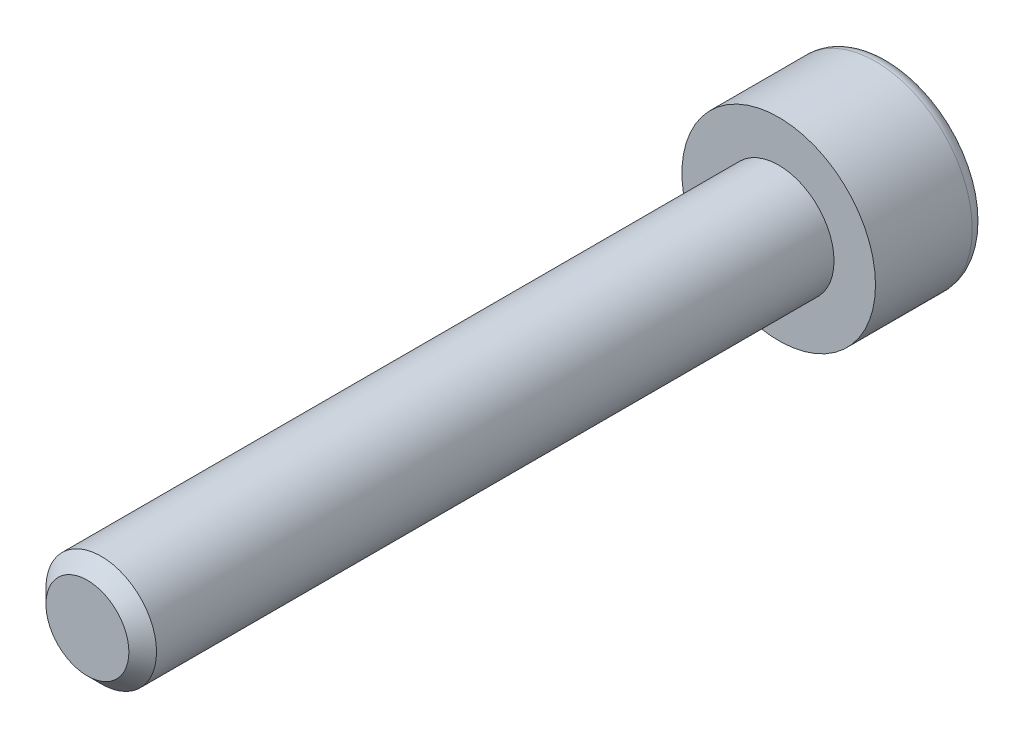
ISO-10303-21;
HEADER;
FILE_DESCRIPTION(('STEP AP214'),'2;1');
FILE_NAME('part.step','',(''),(''),'','','');
FILE_SCHEMA(('AUTOMOTIVE_DESIGN { 1 0 10303 214 1 1 1 1 }'));
ENDSEC;
DATA;
#1=APPLICATION_CONTEXT('core data for automotive mechanical design processes');
#2=APPLICATION_PROTOCOL_DEFINITION('international standard','automotive_design',2000,#1);
#3=PRODUCT_CONTEXT('',#1,'mechanical');
#4=PRODUCT('Part','Part','',(#3));
#5=PRODUCT_RELATED_PRODUCT_CATEGORY('part','',(#4));
#6=PRODUCT_DEFINITION_FORMATION('','',#4);
#7=PRODUCT_DEFINITION_CONTEXT('part definition',#1,'design');
#8=PRODUCT_DEFINITION('design','',#6,#7);
#9=PRODUCT_DEFINITION_SHAPE('','',#8);
#10=(LENGTH_UNIT() NAMED_UNIT(*) SI_UNIT(.MILLI.,.METRE.));
#11=(NAMED_UNIT(*) PLANE_ANGLE_UNIT() SI_UNIT($,.RADIAN.));
#12=(NAMED_UNIT(*) SI_UNIT($,.STERADIAN.) SOLID_ANGLE_UNIT());
#13=UNCERTAINTY_MEASURE_WITH_UNIT(LENGTH_MEASURE(1.E-05),#10,'distance_accuracy_value','');
#14=(GEOMETRIC_REPRESENTATION_CONTEXT(3) GLOBAL_UNCERTAINTY_ASSIGNED_CONTEXT((#13)) GLOBAL_UNIT_ASSIGNED_CONTEXT((#10,
#11,#12)) REPRESENTATION_CONTEXT('',''));
#15=CARTESIAN_POINT('',(0.,0.,0.));
#16=DIRECTION('',(0.,0.,1.));
#17=DIRECTION('',(1.,0.,0.));
#18=AXIS2_PLACEMENT_3D('',#15,#16,#17);
#19=CARTESIAN_POINT('',(0.,0.,4.));
#20=DIRECTION('',(0.,0.,1.));
#21=DIRECTION('',(1.,0.,0.));
#22=AXIS2_PLACEMENT_3D('',#19,#20,#21);
#23=PLANE('',#22);
#24=CARTESIAN_POINT('',(0.,0.,4.));
#25=DIRECTION('',(0.,0.,1.));
#26=DIRECTION('',(1.,0.,0.));
#27=AXIS2_PLACEMENT_3D('',#24,#25,#26);
#28=CIRCLE('',#27,3.5);
#29=CARTESIAN_POINT('',(3.5,0.,4.));
#30=VERTEX_POINT('',#29);
#31=EDGE_CURVE('E143',#30,#30,#28,.T.);
#32=ORIENTED_EDGE('',*,*,#31,.T.);
#33=EDGE_LOOP('',(#32));
#34=FACE_BOUND('',#33,.T.);
#35=CARTESIAN_POINT('',(0.,0.,4.));
#36=DIRECTION('',(0.,0.,1.));
#37=DIRECTION('',(1.,0.,0.));
#38=AXIS2_PLACEMENT_3D('',#35,#36,#37);
#39=CIRCLE('',#38,2.);
#40=CARTESIAN_POINT('',(2.,0.,4.));
#41=VERTEX_POINT('',#40);
#42=EDGE_CURVE('E135',#41,#41,#39,.T.);
#43=ORIENTED_EDGE('',*,*,#42,.F.);
#44=EDGE_LOOP('',(#43));
#45=FACE_BOUND('',#44,.T.);
#46=ADVANCED_FACE('F33',(#34,#45),#23,.T.);
#47=CARTESIAN_POINT('',(0.,0.,4.));
#48=DIRECTION('',(0.,0.,-1.));
#49=DIRECTION('',(-1.,0.,0.));
#50=AXIS2_PLACEMENT_3D('',#47,#48,#49);
#51=CYLINDRICAL_SURFACE('',#50,3.5);
#52=CARTESIAN_POINT('',(0.,0.,0.5));
#53=DIRECTION('',(0.,0.,1.));
#54=DIRECTION('',(1.,0.,0.));
#55=AXIS2_PLACEMENT_3D('',#52,#53,#54);
#56=CIRCLE('',#55,3.5);
#57=CARTESIAN_POINT('',(3.5,0.,0.5));
#58=VERTEX_POINT('',#57);
#59=EDGE_CURVE('E41',#58,#58,#56,.T.);
#60=ORIENTED_EDGE('',*,*,#59,.T.);
#61=EDGE_LOOP('',(#60));
#62=FACE_BOUND('',#61,.T.);
#63=ORIENTED_EDGE('',*,*,#31,.F.);
#64=EDGE_LOOP('',(#63));
#65=FACE_BOUND('',#64,.T.);
#66=ADVANCED_FACE('F154',(#62,#65),#51,.T.);
#67=CARTESIAN_POINT('',(0.,0.,0.));
#68=DIRECTION('',(0.,0.,1.));
#69=DIRECTION('',(1.,0.,0.));
#70=AXIS2_PLACEMENT_3D('',#67,#68,#69);
#71=PLANE('',#70);
#72=CARTESIAN_POINT('',(0.,0.,0.));
#73=DIRECTION('',(0.,0.,1.));
#74=DIRECTION('',(1.,0.,0.));
#75=AXIS2_PLACEMENT_3D('',#72,#73,#74);
#76=CIRCLE('',#75,3.);
#77=CARTESIAN_POINT('',(3.,0.,0.));
#78=VERTEX_POINT('',#77);
#79=EDGE_CURVE('E11',#78,#78,#76,.F.);
#80=ORIENTED_EDGE('',*,*,#79,.T.);
#81=EDGE_LOOP('',(#80));
#82=FACE_BOUND('',#81,.T.);
#83=DIRECTION('',(0.5,0.866025403784438,0.));
#84=VECTOR('',#83,1.);
#85=CARTESIAN_POINT('',(-1.73205080756888,0.,0.));
#86=LINE('',#85,#84);
#87=CARTESIAN_POINT('',(-1.73205080756888,0.,0.));
#88=VERTEX_POINT('',#87);
#89=CARTESIAN_POINT('',(-0.866025403784437,1.5,0.));
#90=VERTEX_POINT('',#89);
#91=EDGE_CURVE('E122',#88,#90,#86,.T.);
#92=ORIENTED_EDGE('',*,*,#91,.F.);
#93=DIRECTION('',(-0.5,0.866025403784439,0.));
#94=VECTOR('',#93,1.);
#95=CARTESIAN_POINT('',(-0.866025403784439,-1.5,0.));
#96=LINE('',#95,#94);
#97=CARTESIAN_POINT('',(-0.866025403784439,-1.5,0.));
#98=VERTEX_POINT('',#97);
#99=EDGE_CURVE('E48',#98,#88,#96,.T.);
#100=ORIENTED_EDGE('',*,*,#99,.F.);
#101=DIRECTION('',(-1.,0.,0.));
#102=VECTOR('',#101,1.);
#103=CARTESIAN_POINT('',(0.866025403784438,-1.5,0.));
#104=LINE('',#103,#102);
#105=CARTESIAN_POINT('',(0.866025403784438,-1.5,0.));
#106=VERTEX_POINT('',#105);
#107=EDGE_CURVE('E131',#106,#98,#104,.T.);
#108=ORIENTED_EDGE('',*,*,#107,.F.);
#109=DIRECTION('',(-0.5,-0.866025403784438,0.));
#110=VECTOR('',#109,1.);
#111=CARTESIAN_POINT('',(1.73205080756888,0.,0.));
#112=LINE('',#111,#110);
#113=CARTESIAN_POINT('',(1.73205080756888,0.,0.));
#114=VERTEX_POINT('',#113);
#115=EDGE_CURVE('E129',#114,#106,#112,.T.);
#116=ORIENTED_EDGE('',*,*,#115,.F.);
#117=DIRECTION('',(0.5,-0.866025403784438,0.));
#118=VECTOR('',#117,1.);
#119=CARTESIAN_POINT('',(0.866025403784438,1.5,0.));
#120=LINE('',#119,#118);
#121=CARTESIAN_POINT('',(0.866025403784438,1.5,0.));
#122=VERTEX_POINT('',#121);
#123=EDGE_CURVE('E96',#122,#114,#120,.T.);
#124=ORIENTED_EDGE('',*,*,#123,.F.);
#125=DIRECTION('',(1.,0.,0.));
#126=VECTOR('',#125,1.);
#127=CARTESIAN_POINT('',(-0.866025403784437,1.5,0.));
#128=LINE('',#127,#126);
#129=EDGE_CURVE('E125',#90,#122,#128,.T.);
#130=ORIENTED_EDGE('',*,*,#129,.F.);
#131=EDGE_LOOP('',(#92,#100,#108,#116,#124,#130));
#132=FACE_BOUND('',#131,.T.);
#133=ADVANCED_FACE('F171',(#82,#132),#71,.F.);
#134=CARTESIAN_POINT('',(0.,0.,29.));
#135=DIRECTION('',(0.,0.,-1.));
#136=DIRECTION('',(-1.,0.,0.));
#137=AXIS2_PLACEMENT_3D('',#134,#135,#136);
#138=CYLINDRICAL_SURFACE('',#137,2.);
#139=CARTESIAN_POINT('',(0.,0.,28.5));
#140=DIRECTION('',(0.,0.,1.));
#141=DIRECTION('',(1.,0.,0.));
#142=AXIS2_PLACEMENT_3D('',#139,#140,#141);
#143=CIRCLE('',#142,2.);
#144=CARTESIAN_POINT('',(2.,0.,28.5));
#145=VERTEX_POINT('',#144);
#146=EDGE_CURVE('E149',#145,#145,#143,.F.);
#147=ORIENTED_EDGE('',*,*,#146,.T.);
#148=EDGE_LOOP('',(#147));
#149=FACE_BOUND('',#148,.T.);
#150=ORIENTED_EDGE('',*,*,#42,.T.);
#151=EDGE_LOOP('',(#150));
#152=FACE_BOUND('',#151,.T.);
#153=ADVANCED_FACE('F176',(#149,#152),#138,.T.);
#154=CARTESIAN_POINT('',(0.,0.,29.));
#155=DIRECTION('',(0.,0.,1.));
#156=DIRECTION('',(1.,0.,0.));
#157=AXIS2_PLACEMENT_3D('',#154,#155,#156);
#158=PLANE('',#157);
#159=CARTESIAN_POINT('',(0.,0.,29.));
#160=DIRECTION('',(0.,0.,1.));
#161=DIRECTION('',(1.,0.,0.));
#162=AXIS2_PLACEMENT_3D('',#159,#160,#161);
#163=CIRCLE('',#162,1.49999999999999);
#164=CARTESIAN_POINT('',(1.49999999999999,0.,29.));
#165=VERTEX_POINT('',#164);
#166=EDGE_CURVE('E146',#165,#165,#163,.T.);
#167=ORIENTED_EDGE('',*,*,#166,.T.);
#168=EDGE_LOOP('',(#167));
#169=FACE_BOUND('',#168,.T.);
#170=ADVANCED_FACE('F183',(#169),#158,.T.);
#171=CARTESIAN_POINT('',(-0.866025403784439,-1.5,3.));
#172=DIRECTION('',(-0.866025403784438,-0.5,0.));
#173=DIRECTION('',(0.5,-0.866025403784439,0.));
#174=AXIS2_PLACEMENT_3D('',#171,#172,#173);
#175=PLANE('',#174);
#176=ORIENTED_EDGE('',*,*,#99,.T.);
#177=DIRECTION('',(0.,0.,-1.));
#178=VECTOR('',#177,1.);
#179=CARTESIAN_POINT('',(-1.73205080756888,0.,3.));
#180=LINE('',#179,#178);
#181=CARTESIAN_POINT('',(-1.73205080756888,0.,3.));
#182=VERTEX_POINT('',#181);
#183=EDGE_CURVE('E78',#182,#88,#180,.T.);
#184=ORIENTED_EDGE('',*,*,#183,.F.);
#185=DIRECTION('',(-0.5,0.866025403784439,0.));
#186=VECTOR('',#185,1.);
#187=CARTESIAN_POINT('',(-0.866025403784439,-1.5,3.));
#188=LINE('',#187,#186);
#189=CARTESIAN_POINT('',(-0.866025403784439,-1.5,3.));
#190=VERTEX_POINT('',#189);
#191=EDGE_CURVE('E133',#190,#182,#188,.T.);
#192=ORIENTED_EDGE('',*,*,#191,.F.);
#193=DIRECTION('',(0.,0.,-1.));
#194=VECTOR('',#193,1.);
#195=CARTESIAN_POINT('',(-0.866025403784439,-1.5,3.));
#196=LINE('',#195,#194);
#197=EDGE_CURVE('E56',#190,#98,#196,.T.);
#198=ORIENTED_EDGE('',*,*,#197,.T.);
#199=EDGE_LOOP('',(#176,#184,#192,#198));
#200=FACE_BOUND('',#199,.T.);
#201=ADVANCED_FACE('F192',(#200),#175,.F.);
#202=CARTESIAN_POINT('',(0.866025403784438,-1.5,3.));
#203=DIRECTION('',(0.,-1.,0.));
#204=DIRECTION('',(1.,0.,0.));
#205=AXIS2_PLACEMENT_3D('',#202,#203,#204);
#206=PLANE('',#205);
#207=ORIENTED_EDGE('',*,*,#107,.T.);
#208=ORIENTED_EDGE('',*,*,#197,.F.);
#209=DIRECTION('',(-1.,0.,0.));
#210=VECTOR('',#209,1.);
#211=CARTESIAN_POINT('',(0.866025403784438,-1.5,3.));
#212=LINE('',#211,#210);
#213=CARTESIAN_POINT('',(0.866025403784438,-1.5,3.));
#214=VERTEX_POINT('',#213);
#215=EDGE_CURVE('E108',#214,#190,#212,.T.);
#216=ORIENTED_EDGE('',*,*,#215,.F.);
#217=DIRECTION('',(0.,0.,-1.));
#218=VECTOR('',#217,1.);
#219=CARTESIAN_POINT('',(0.866025403784438,-1.5,3.));
#220=LINE('',#219,#218);
#221=EDGE_CURVE('E100',#214,#106,#220,.T.);
#222=ORIENTED_EDGE('',*,*,#221,.T.);
#223=EDGE_LOOP('',(#207,#208,#216,#222));
#224=FACE_BOUND('',#223,.T.);
#225=ADVANCED_FACE('F194',(#224),#206,.F.);
#226=CARTESIAN_POINT('',(1.73205080756888,0.,3.));
#227=DIRECTION('',(0.866025403784439,-0.5,0.));
#228=DIRECTION('',(0.5,0.866025403784439,0.));
#229=AXIS2_PLACEMENT_3D('',#226,#227,#228);
#230=PLANE('',#229);
#231=ORIENTED_EDGE('',*,*,#115,.T.);
#232=ORIENTED_EDGE('',*,*,#221,.F.);
#233=DIRECTION('',(-0.5,-0.866025403784438,0.));
#234=VECTOR('',#233,1.);
#235=CARTESIAN_POINT('',(1.73205080756888,0.,3.));
#236=LINE('',#235,#234);
#237=CARTESIAN_POINT('',(1.73205080756888,0.,3.));
#238=VERTEX_POINT('',#237);
#239=EDGE_CURVE('E104',#238,#214,#236,.T.);
#240=ORIENTED_EDGE('',*,*,#239,.F.);
#241=DIRECTION('',(0.,0.,-1.));
#242=VECTOR('',#241,1.);
#243=CARTESIAN_POINT('',(1.73205080756888,0.,3.));
#244=LINE('',#243,#242);
#245=EDGE_CURVE('E89',#238,#114,#244,.T.);
#246=ORIENTED_EDGE('',*,*,#245,.T.);
#247=EDGE_LOOP('',(#231,#232,#240,#246));
#248=FACE_BOUND('',#247,.T.);
#249=ADVANCED_FACE('F105',(#248),#230,.F.);
#250=CARTESIAN_POINT('',(0.866025403784438,1.5,3.));
#251=DIRECTION('',(0.866025403784439,0.5,0.));
#252=DIRECTION('',(-0.5,0.866025403784439,0.));
#253=AXIS2_PLACEMENT_3D('',#250,#251,#252);
#254=PLANE('',#253);
#255=ORIENTED_EDGE('',*,*,#123,.T.);
#256=ORIENTED_EDGE('',*,*,#245,.F.);
#257=DIRECTION('',(0.5,-0.866025403784438,0.));
#258=VECTOR('',#257,1.);
#259=CARTESIAN_POINT('',(0.866025403784438,1.5,3.));
#260=LINE('',#259,#258);
#261=CARTESIAN_POINT('',(0.866025403784438,1.5,3.));
#262=VERTEX_POINT('',#261);
#263=EDGE_CURVE('E93',#262,#238,#260,.T.);
#264=ORIENTED_EDGE('',*,*,#263,.F.);
#265=DIRECTION('',(0.,0.,-1.));
#266=VECTOR('',#265,1.);
#267=CARTESIAN_POINT('',(0.866025403784438,1.5,3.));
#268=LINE('',#267,#266);
#269=EDGE_CURVE('E101',#262,#122,#268,.T.);
#270=ORIENTED_EDGE('',*,*,#269,.T.);
#271=EDGE_LOOP('',(#255,#256,#264,#270));
#272=FACE_BOUND('',#271,.T.);
#273=ADVANCED_FACE('F91',(#272),#254,.F.);
#274=CARTESIAN_POINT('',(-0.866025403784437,1.5,3.));
#275=DIRECTION('',(0.,1.,0.));
#276=DIRECTION('',(0.,0.,1.));
#277=AXIS2_PLACEMENT_3D('',#274,#275,#276);
#278=PLANE('',#277);
#279=ORIENTED_EDGE('',*,*,#129,.T.);
#280=ORIENTED_EDGE('',*,*,#269,.F.);
#281=DIRECTION('',(1.,0.,0.));
#282=VECTOR('',#281,1.);
#283=CARTESIAN_POINT('',(-0.866025403784437,1.5,3.));
#284=LINE('',#283,#282);
#285=CARTESIAN_POINT('',(-0.866025403784437,1.5,3.));
#286=VERTEX_POINT('',#285);
#287=EDGE_CURVE('E114',#286,#262,#284,.T.);
#288=ORIENTED_EDGE('',*,*,#287,.F.);
#289=DIRECTION('',(0.,0.,-1.));
#290=VECTOR('',#289,1.);
#291=CARTESIAN_POINT('',(-0.866025403784437,1.5,3.));
#292=LINE('',#291,#290);
#293=EDGE_CURVE('E138',#286,#90,#292,.T.);
#294=ORIENTED_EDGE('',*,*,#293,.T.);
#295=EDGE_LOOP('',(#279,#280,#288,#294));
#296=FACE_BOUND('',#295,.T.);
#297=ADVANCED_FACE('F205',(#296),#278,.F.);
#298=CARTESIAN_POINT('',(-1.73205080756888,0.,3.));
#299=DIRECTION('',(-0.866025403784438,0.500000000000001,0.));
#300=DIRECTION('',(-0.500000000000001,-0.866025403784438,0.));
#301=AXIS2_PLACEMENT_3D('',#298,#299,#300);
#302=PLANE('',#301);
#303=ORIENTED_EDGE('',*,*,#91,.T.);
#304=ORIENTED_EDGE('',*,*,#293,.F.);
#305=DIRECTION('',(0.5,0.866025403784438,0.));
#306=VECTOR('',#305,1.);
#307=CARTESIAN_POINT('',(-1.73205080756888,0.,3.));
#308=LINE('',#307,#306);
#309=EDGE_CURVE('E116',#182,#286,#308,.T.);
#310=ORIENTED_EDGE('',*,*,#309,.F.);
#311=ORIENTED_EDGE('',*,*,#183,.T.);
#312=EDGE_LOOP('',(#303,#304,#310,#311));
#313=FACE_BOUND('',#312,.T.);
#314=ADVANCED_FACE('F190',(#313),#302,.F.);
#315=CARTESIAN_POINT('',(0.,0.,3.));
#316=DIRECTION('',(0.,0.,-1.));
#317=DIRECTION('',(-1.,0.,0.));
#318=AXIS2_PLACEMENT_3D('',#315,#316,#317);
#319=PLANE('',#318);
#320=ORIENTED_EDGE('',*,*,#191,.T.);
#321=ORIENTED_EDGE('',*,*,#309,.T.);
#322=ORIENTED_EDGE('',*,*,#287,.T.);
#323=ORIENTED_EDGE('',*,*,#263,.T.);
#324=ORIENTED_EDGE('',*,*,#239,.T.);
#325=ORIENTED_EDGE('',*,*,#215,.T.);
#326=EDGE_LOOP('',(#320,#321,#322,#323,#324,#325));
#327=FACE_BOUND('',#326,.T.);
#328=ADVANCED_FACE('F111',(#327),#319,.T.);
#329=CARTESIAN_POINT('',(0.,0.,29.));
#330=DIRECTION('',(0.,0.,-1.));
#331=DIRECTION('',(-1.,0.,0.));
#332=AXIS2_PLACEMENT_3D('',#329,#330,#331);
#333=CONICAL_SURFACE('',#332,1.49999999999999,0.785398163397447);
#334=ORIENTED_EDGE('',*,*,#146,.F.);
#335=EDGE_LOOP('',(#334));
#336=FACE_BOUND('',#335,.T.);
#337=ORIENTED_EDGE('',*,*,#166,.F.);
#338=EDGE_LOOP('',(#337));
#339=FACE_BOUND('',#338,.T.);
#340=ADVANCED_FACE('F158',(#336,#339),#333,.T.);
#341=CARTESIAN_POINT('',(0.,0.,0.5));
#342=DIRECTION('',(0.,0.,1.));
#343=DIRECTION('',(1.,0.,0.));
#344=AXIS2_PLACEMENT_3D('',#341,#342,#343);
#345=TOROIDAL_SURFACE('',#344,3.,0.5);
#346=ORIENTED_EDGE('',*,*,#79,.F.);
#347=EDGE_LOOP('',(#346));
#348=FACE_BOUND('',#347,.T.);
#349=ORIENTED_EDGE('',*,*,#59,.F.);
#350=EDGE_LOOP('',(#349));
#351=FACE_BOUND('',#350,.T.);
#352=ADVANCED_FACE('F35',(#348,#351),#345,.T.);
#353=CLOSED_SHELL('',(#46,#66,#133,#153,#170,#201,#225,#249,#273,#297,#314,#328,#340,#352));
#354=MANIFOLD_SOLID_BREP('B2',#353);
#355=ADVANCED_BREP_SHAPE_REPRESENTATION('',(#18,#354),#14);
#356=SHAPE_DEFINITION_REPRESENTATION(#9,#355);
ENDSEC;
END-ISO-10303-21;
